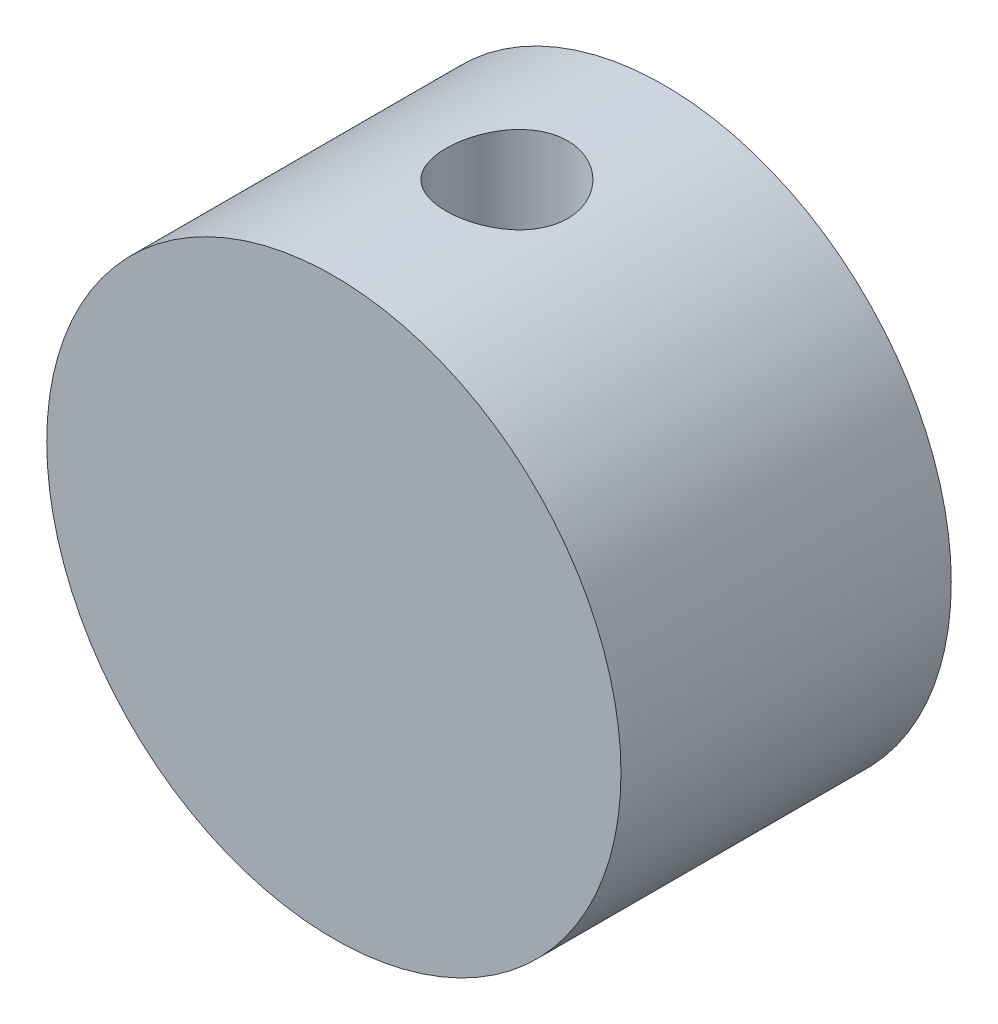
ISO-10303-21;
HEADER;
FILE_DESCRIPTION(('STEP AP214'),'2;1');
FILE_NAME('part.step','',(''),(''),'','','');
FILE_SCHEMA(('AUTOMOTIVE_DESIGN { 1 0 10303 214 1 1 1 1 }'));
ENDSEC;
DATA;
#1=APPLICATION_CONTEXT('core data for automotive mechanical design processes');
#2=APPLICATION_PROTOCOL_DEFINITION('international standard','automotive_design',2000,#1);
#3=PRODUCT_CONTEXT('',#1,'mechanical');
#4=PRODUCT('Part','Part','',(#3));
#5=PRODUCT_RELATED_PRODUCT_CATEGORY('part','',(#4));
#6=PRODUCT_DEFINITION_FORMATION('','',#4);
#7=PRODUCT_DEFINITION_CONTEXT('part definition',#1,'design');
#8=PRODUCT_DEFINITION('design','',#6,#7);
#9=PRODUCT_DEFINITION_SHAPE('','',#8);
#10=(LENGTH_UNIT() NAMED_UNIT(*) SI_UNIT(.MILLI.,.METRE.));
#11=(NAMED_UNIT(*) PLANE_ANGLE_UNIT() SI_UNIT($,.RADIAN.));
#12=(NAMED_UNIT(*) SI_UNIT($,.STERADIAN.) SOLID_ANGLE_UNIT());
#13=UNCERTAINTY_MEASURE_WITH_UNIT(LENGTH_MEASURE(1.E-05),#10,'distance_accuracy_value','');
#14=(GEOMETRIC_REPRESENTATION_CONTEXT(3) GLOBAL_UNCERTAINTY_ASSIGNED_CONTEXT((#13)) GLOBAL_UNIT_ASSIGNED_CONTEXT((#10,
#11,#12)) REPRESENTATION_CONTEXT('',''));
#15=CARTESIAN_POINT('',(0.,0.,0.));
#16=DIRECTION('',(0.,0.,1.));
#17=DIRECTION('',(1.,0.,0.));
#18=AXIS2_PLACEMENT_3D('',#15,#16,#17);
#19=CARTESIAN_POINT('',(0.,0.,19.));
#20=DIRECTION('',(0.,0.,-1.));
#21=DIRECTION('',(-1.,0.,0.));
#22=AXIS2_PLACEMENT_3D('',#19,#20,#21);
#23=CYLINDRICAL_SURFACE('',#22,16.515);
#24=CARTESIAN_POINT('',(-14.7761661082379,7.37632294180248,9.5));
#25=CARTESIAN_POINT('',(-14.7761652243296,7.37632528414198,9.44388483014353));
#26=CARTESIAN_POINT('',(-14.7740472993496,7.38057204953592,9.38773028243603));
#27=CARTESIAN_POINT('',(-14.7656081753143,7.39744048464333,9.2769715054375));
#28=CARTESIAN_POINT('',(-14.7592820735609,7.41007192280703,9.22236916198914));
#29=CARTESIAN_POINT('',(-14.7425473387191,7.44331022843231,9.11633519685663));
#30=CARTESIAN_POINT('',(-14.7321408479884,7.46391291061587,9.06490192766041));
#31=CARTESIAN_POINT('',(-14.7074501442354,7.51244786938125,8.96664731382157));
#32=CARTESIAN_POINT('',(-14.6931668237851,7.54037845879169,8.91982491098532));
#33=CARTESIAN_POINT('',(-14.660989230412,7.60275273454493,8.83204115451057));
#34=CARTESIAN_POINT('',(-14.64309046402,7.63720452239516,8.79108720384865));
#35=CARTESIAN_POINT('',(-14.6040723570013,7.7115533075833,8.71626620352635));
#36=CARTESIAN_POINT('',(-14.5829528825994,7.75145053109501,8.68239944837764));
#37=CARTESIAN_POINT('',(-14.5379523546034,7.83552410036968,8.62269189559942));
#38=CARTESIAN_POINT('',(-14.514069236682,7.87970364079492,8.59685715134838));
#39=CARTESIAN_POINT('',(-14.4641285980377,7.97100455324249,8.5539857491042));
#40=CARTESIAN_POINT('',(-14.4380710994283,8.0181258953456,8.53694900164846));
#41=CARTESIAN_POINT('',(-14.3844831930307,8.11386914763816,8.51217754744945));
#42=CARTESIAN_POINT('',(-14.3569546489544,8.16248912757433,8.50443134900294));
#43=CARTESIAN_POINT('',(-14.301144167903,8.25988196198706,8.49842539493915));
#44=CARTESIAN_POINT('',(-14.2728622389861,8.30865481482354,8.50016553789406));
#45=CARTESIAN_POINT('',(-14.2163949655969,8.40490626394991,8.51307338110252));
#46=CARTESIAN_POINT('',(-14.1882095431099,8.4523864732439,8.52422871834687));
#47=CARTESIAN_POINT('',(-14.1327455179071,8.54480165986377,8.55563110945947));
#48=CARTESIAN_POINT('',(-14.1054669202891,8.58973662288239,8.57587821442836));
#49=CARTESIAN_POINT('',(-14.0526542746077,8.67586822544373,8.62490341568168));
#50=CARTESIAN_POINT('',(-14.027121386936,8.71706238429111,8.65368711977945));
#51=CARTESIAN_POINT('',(-13.978650281993,8.79458097746715,8.71896437298439));
#52=CARTESIAN_POINT('',(-13.9557120920705,8.83090536046791,8.75545800334445));
#53=CARTESIAN_POINT('',(-13.9131667705874,8.89778581949954,8.83518902398001));
#54=CARTESIAN_POINT('',(-13.8935650445289,8.92833254371431,8.87843714410653));
#55=CARTESIAN_POINT('',(-13.8584174267222,8.98279162308439,8.97041187910648));
#56=CARTESIAN_POINT('',(-13.8428715364849,9.00670397576837,9.01913849602066));
#57=CARTESIAN_POINT('',(-13.8163875966016,9.04727852696736,9.12069386118637));
#58=CARTESIAN_POINT('',(-13.8054497867521,9.06394034817897,9.17352282274731));
#59=CARTESIAN_POINT('',(-13.7885802159207,9.08958295216907,9.28178014336961));
#60=CARTESIAN_POINT('',(-13.7826483996805,9.09856381973332,9.33720847373086));
#61=CARTESIAN_POINT('',(-13.7760140623172,9.10860573797921,9.44899692513167));
#62=CARTESIAN_POINT('',(-13.7753032551641,9.10967933793887,9.50535542737751));
#63=CARTESIAN_POINT('',(-13.7791152253338,9.1039123508736,9.61748721611554));
#64=CARTESIAN_POINT('',(-13.7836379771199,9.09707180246506,9.67326050546188));
#65=CARTESIAN_POINT('',(-13.7977454800249,9.07566014935453,9.78259626830247));
#66=CARTESIAN_POINT('',(-13.8073264419236,9.06109483141567,9.83616036441343));
#67=CARTESIAN_POINT('',(-13.8312005273048,9.0246102135982,9.93960731856602));
#68=CARTESIAN_POINT('',(-13.845493690895,9.00269085112575,9.98949014527017));
#69=CARTESIAN_POINT('',(-13.8783039639915,8.95202840548346,10.0842275403652));
#70=CARTESIAN_POINT('',(-13.896826371324,8.9232767618976,10.129075695992));
#71=CARTESIAN_POINT('',(-13.9374395170237,8.85970787114894,10.2124060901591));
#72=CARTESIAN_POINT('',(-13.9595302882587,8.82489056811577,10.2508882700566));
#73=CARTESIAN_POINT('',(-14.0065618989229,8.75005147365633,10.3204450040569));
#74=CARTESIAN_POINT('',(-14.0315064119925,8.71002296445924,10.3515098473893));
#75=CARTESIAN_POINT('',(-14.0833999986001,8.6258628659427,10.4052836521311));
#76=CARTESIAN_POINT('',(-14.1103490603897,8.58173130067032,10.4279926625083));
#77=CARTESIAN_POINT('',(-14.1653752231236,8.49059473438645,10.4643932696884));
#78=CARTESIAN_POINT('',(-14.193451539888,8.44359171943399,10.4780910237219));
#79=CARTESIAN_POINT('',(-14.249891640185,8.34798738262633,10.4961004418209));
#80=CARTESIAN_POINT('',(-14.2782554210928,8.29938607535561,10.5004121915102));
#81=CARTESIAN_POINT('',(-14.3343980329704,8.20203696404428,10.499526381745));
#82=CARTESIAN_POINT('',(-14.3621777272097,8.15328951879389,10.4943440253942));
#83=CARTESIAN_POINT('',(-14.4164331583958,8.05696820571649,10.4746486173371));
#84=CARTESIAN_POINT('',(-14.4429088930186,8.00939433998115,10.4601355490019));
#85=CARTESIAN_POINT('',(-14.4938685289415,7.91680459234177,10.4221940714782));
#86=CARTESIAN_POINT('',(-14.5183524386728,7.8717886996102,10.3987657000301));
#87=CARTESIAN_POINT('',(-14.5647314934381,7.7856417728284,10.3436608450192));
#88=CARTESIAN_POINT('',(-14.5866267076915,7.74451063490913,10.3119845820702));
#89=CARTESIAN_POINT('',(-14.6273595146655,7.66730006386913,10.2412271603635));
#90=CARTESIAN_POINT('',(-14.6461925134038,7.63122823173418,10.2021350631772));
#91=CARTESIAN_POINT('',(-14.6803595576154,7.56529254205189,10.1176693560236));
#92=CARTESIAN_POINT('',(-14.6956927448835,7.53543020732414,10.0722942097334));
#93=CARTESIAN_POINT('',(-14.7225560205894,7.48281002184311,9.9765013479683));
#94=CARTESIAN_POINT('',(-14.7340815511758,7.46006068724397,9.92607768266163));
#95=CARTESIAN_POINT('',(-14.7530674489264,7.42244393603233,9.82169906561605));
#96=CARTESIAN_POINT('',(-14.760532584486,7.40756727456749,9.76774833975164));
#97=CARTESIAN_POINT('',(-14.7693157895934,7.39003316305229,9.67788888213308));
#98=CARTESIAN_POINT('',(-14.7718822936726,7.38489901213253,9.64256121242076));
#99=CARTESIAN_POINT('',(-14.7753077334888,7.37804315748207,9.57149435714344));
#100=CARTESIAN_POINT('',(-14.776166671442,7.37632144932277,9.53575517211256));
#101=CARTESIAN_POINT('',(-14.7761661082379,7.37632294180248,9.5));
#102=B_SPLINE_CURVE_WITH_KNOTS('',3,(#24,#25,#26,#27,#28,#29,#30,#31,#32,#33,#34,#35,#36,#37,
#38,#39,#40,#41,#42,#43,#44,#45,#46,#47,#48,#49,#50,#51,#52,#53,#54,#55,#56,#57,#58,#59,#60,#61,
#62,#63,#64,#65,#66,#67,#68,#69,#70,#71,#72,#73,#74,#75,#76,#77,#78,#79,#80,#81,#82,#83,#84,#85,
#86,#87,#88,#89,#90,#91,#92,#93,#94,#95,#96,#97,#98,#99,#100,#101),.UNSPECIFIED.,.T.,.F.,(4,2,2,
2,2,2,2,2,2,2,2,2,2,2,2,2,2,2,2,2,2,2,2,2,2,2,2,2,2,2,2,2,2,2,2,2,2,2,4),(0.,0.168214982353931,
0.336626286081308,0.504949285687176,0.673233564700608,0.841728297730832,1.01023003124736,
1.17885845108508,1.34748515618787,1.51590306704608,1.68431917718607,1.85251448504303,
2.02071073826053,2.18901772765079,2.35732649087288,2.52590539283143,2.6944843575862,
2.8630720938102,3.03165796906472,3.19997623129221,3.36829367222903,3.53648520128911,
3.70467816194535,3.87308297931276,4.04148934792718,4.21011499972513,4.37873966330937,
4.54724898867133,4.71575677680375,4.88399496583638,5.05223345469998,5.22047123138157,
5.38870450851418,5.55718788846907,5.72571253874908,5.89443819204182,6.06296526924675,
6.17014775603146,6.27733010371677),.UNSPECIFIED.);
#103=CARTESIAN_POINT('',(-14.7761661082379,7.37632294180248,9.5));
#104=VERTEX_POINT('',#103);
#105=EDGE_CURVE('E72',#104,#104,#102,.T.);
#106=ORIENTED_EDGE('',*,*,#105,.T.);
#107=EDGE_LOOP('',(#106));
#108=FACE_BOUND('',#107,.T.);
#109=CARTESIAN_POINT('',(0.,0.,19.));
#110=DIRECTION('',(0.,0.,1.));
#111=DIRECTION('',(1.,0.,0.));
#112=AXIS2_PLACEMENT_3D('',#109,#110,#111);
#113=CIRCLE('',#112,16.515);
#114=CARTESIAN_POINT('',(16.515,0.,19.));
#115=VERTEX_POINT('',#114);
#116=EDGE_CURVE('E75',#115,#115,#113,.T.);
#117=ORIENTED_EDGE('',*,*,#116,.F.);
#118=EDGE_LOOP('',(#117));
#119=FACE_BOUND('',#118,.T.);
#120=CARTESIAN_POINT('',(0.,0.,0.));
#121=DIRECTION('',(0.,0.,1.));
#122=DIRECTION('',(1.,0.,0.));
#123=AXIS2_PLACEMENT_3D('',#120,#121,#122);
#124=CIRCLE('',#123,16.515);
#125=CARTESIAN_POINT('',(16.515,0.,0.));
#126=VERTEX_POINT('',#125);
#127=EDGE_CURVE('E71',#126,#126,#124,.T.);
#128=ORIENTED_EDGE('',*,*,#127,.T.);
#129=EDGE_LOOP('',(#128));
#130=FACE_BOUND('',#129,.T.);
#131=CARTESIAN_POINT('',(0.,16.515,5.54522428194513));
#132=CARTESIAN_POINT('',(-0.194268258408886,16.5149964042745,5.54523111698136));
#133=CARTESIAN_POINT('',(-0.388620498995079,16.5115372295373,5.56145325990692));
#134=CARTESIAN_POINT('',(-0.771814509390183,16.4980718368677,5.62585176936592));
#135=CARTESIAN_POINT('',(-0.960652068179765,16.4880607457351,5.67405192094645));
#136=CARTESIAN_POINT('',(-1.32722247979265,16.4626073818898,5.80083694613491));
#137=CARTESIAN_POINT('',(-1.50496636451044,16.4471706093437,5.87939105706124));
#138=CARTESIAN_POINT('',(-1.84474309290281,16.4125364275293,6.06455878396817));
#139=CARTESIAN_POINT('',(-2.00677653826298,16.3933391623673,6.17117132477285));
#140=CARTESIAN_POINT('',(-2.31299070870651,16.3529662194163,6.41113619883583));
#141=CARTESIAN_POINT('',(-2.45689986614495,16.3317672644705,6.54483118924274));
#142=CARTESIAN_POINT('',(-2.72042687219415,16.2899461771844,6.8344298550082));
#143=CARTESIAN_POINT('',(-2.84004265848192,16.2693240939443,6.99033541396564));
#144=CARTESIAN_POINT('',(-3.05276989700587,16.2307630178514,7.32191726963809));
#145=CARTESIAN_POINT('',(-3.1455951892687,16.2128538996209,7.49778093656089));
#146=CARTESIAN_POINT('',(-3.30027177619758,16.1820793325168,7.86305244088626));
#147=CARTESIAN_POINT('',(-3.36212653204076,16.1692133200753,8.0524587620962));
#148=CARTESIAN_POINT('',(-3.45221460727988,16.1502182138022,8.43650195279116));
#149=CARTESIAN_POINT('',(-3.48092714780599,16.1439931969438,8.63102156336904));
#150=CARTESIAN_POINT('',(-3.50540524763926,16.1386965865558,9.02220890576597));
#151=CARTESIAN_POINT('',(-3.50117460094208,16.1396241692767,9.21887638761424));
#152=CARTESIAN_POINT('',(-3.46027273988694,16.1484409909182,9.60523541741545));
#153=CARTESIAN_POINT('',(-3.42415546783608,16.1562113496322,9.79498872998032));
#154=CARTESIAN_POINT('',(-3.32138199819804,16.1776505348042,10.1656802206517));
#155=CARTESIAN_POINT('',(-3.25472418171473,16.1913196739432,10.3466179308973));
#156=CARTESIAN_POINT('',(-3.09224562921909,16.2231350348401,10.6961138789394));
#157=CARTESIAN_POINT('',(-2.99620945631786,16.2413141362867,10.8645688439489));
#158=CARTESIAN_POINT('',(-2.7778519786253,16.2800805840243,11.1831786154098));
#159=CARTESIAN_POINT('',(-2.65552729929598,16.3006682393359,11.3333310685679));
#160=CARTESIAN_POINT('',(-2.38512033539038,16.34244400857,11.6142654746604));
#161=CARTESIAN_POINT('',(-2.23656635240011,16.3636358365481,11.7445932755464));
#162=CARTESIAN_POINT('',(-1.91947432818689,16.4038514926646,11.9785567593361));
#163=CARTESIAN_POINT('',(-1.75093596669967,16.4228752860491,12.0821920143877));
#164=CARTESIAN_POINT('',(-1.39812365682072,16.4566673423158,12.2599302135396));
#165=CARTESIAN_POINT('',(-1.21382032424898,16.4714274237781,12.333976483794));
#166=CARTESIAN_POINT('',(-0.835005893131743,16.4949677559984,12.4499249360139));
#167=CARTESIAN_POINT('',(-0.640496190077172,16.5037488219691,12.491831500187));
#168=CARTESIAN_POINT('',(-0.250688650011093,16.5142266325189,12.5416569743443));
#169=CARTESIAN_POINT('',(-0.0554735389885598,16.5160527579378,12.5501966776535));
#170=CARTESIAN_POINT('',(0.333593873323456,16.5127763021464,12.5347246383598));
#171=CARTESIAN_POINT('',(0.527446260324851,16.5076741606977,12.5107149617819));
#172=CARTESIAN_POINT('',(0.90624876475028,16.491195846503,12.4313408847759));
#173=CARTESIAN_POINT('',(1.09126961895986,16.4798843313503,12.3762994577831));
#174=CARTESIAN_POINT('',(1.44945407289572,16.4522523004087,12.2367807163541));
#175=CARTESIAN_POINT('',(1.62261670471487,16.4359313763299,12.1523010024866));
#176=CARTESIAN_POINT('',(1.95475537773441,16.3997704570263,11.9549918968582));
#177=CARTESIAN_POINT('',(2.11350779640806,16.3798858399736,11.8417944283759));
#178=CARTESIAN_POINT('',(2.40998681531251,16.3388992309484,11.590750774461));
#179=CARTESIAN_POINT('',(2.54771085956256,16.3177970914159,11.452901597049));
#180=CARTESIAN_POINT('',(2.80065638710283,16.2763108718577,11.1536269880036));
#181=CARTESIAN_POINT('',(2.91544932665819,16.2559454253662,10.9918363039815));
#182=CARTESIAN_POINT('',(3.11623420392054,16.2186553237612,10.6509064182606));
#183=CARTESIAN_POINT('',(3.20222735856354,16.2017305232749,10.4717679500054));
#184=CARTESIAN_POINT('',(3.34240988179037,16.1733930002063,10.102171034266));
#185=CARTESIAN_POINT('',(3.39677356752524,16.1619501284005,9.91178112688893));
#186=CARTESIAN_POINT('',(3.47267189811315,16.1458139402897,9.52429702883277));
#187=CARTESIAN_POINT('',(3.4942114259723,16.1411196200586,9.32720383981166));
#188=CARTESIAN_POINT('',(3.5036521745112,16.1390725314134,8.93622176847247));
#189=CARTESIAN_POINT('',(3.49223196375259,16.1415716627976,8.74234973449314));
#190=CARTESIAN_POINT('',(3.43758718380125,16.153296454035,8.35935893324618));
#191=CARTESIAN_POINT('',(3.39436294296578,16.1625220444417,8.17024011692532));
#192=CARTESIAN_POINT('',(3.27765572139555,16.1865902644964,7.80262320789376));
#193=CARTESIAN_POINT('',(3.20426571815857,16.2014156231477,7.62409439248658));
#194=CARTESIAN_POINT('',(3.02939235299252,16.2350207885067,7.28178087914111));
#195=CARTESIAN_POINT('',(2.92790627319603,16.2538009777419,7.11799760964202));
#196=CARTESIAN_POINT('',(2.6974459379001,16.2936461712115,6.80646658149573));
#197=CARTESIAN_POINT('',(2.56798564902923,16.3147478335082,6.65908299498383));
#198=CARTESIAN_POINT('',(2.28624384956393,16.3566059180029,6.38790882014598));
#199=CARTESIAN_POINT('',(2.13395708591303,16.3773622595074,6.26412367746565));
#200=CARTESIAN_POINT('',(1.80868183047199,16.4164862722369,6.04224293718726));
#201=CARTESIAN_POINT('',(1.63546656579737,16.4348222428316,5.94447391247287));
#202=CARTESIAN_POINT('',(1.27471487973924,16.4667239850175,5.77959074459904));
#203=CARTESIAN_POINT('',(1.08719096991871,16.4802938672182,5.71245017030054));
#204=CARTESIAN_POINT('',(0.749491188002404,16.4986325451218,5.62308500240277));
#205=CARTESIAN_POINT('',(0.601179479365196,16.504733114025,5.59394155816324));
#206=CARTESIAN_POINT('',(0.301928688567538,16.5129181597652,5.55500892266337));
#207=CARTESIAN_POINT('',(0.150989710059184,16.5150027946796,5.54521896959946));
#208=CARTESIAN_POINT('',(0.,16.515,5.54522428194513));
#209=B_SPLINE_CURVE_WITH_KNOTS('',3,(#131,#132,#133,#134,#135,#136,#137,#138,#139,#140,#141,
#142,#143,#144,#145,#146,#147,#148,#149,#150,#151,#152,#153,#154,#155,#156,#157,#158,#159,#160,
#161,#162,#163,#164,#165,#166,#167,#168,#169,#170,#171,#172,#173,#174,#175,#176,#177,#178,#179,
#180,#181,#182,#183,#184,#185,#186,#187,#188,#189,#190,#191,#192,#193,#194,#195,#196,#197,#198,
#199,#200,#201,#202,#203,#204,#205,#206,#207,#208),.UNSPECIFIED.,.T.,.F.,(4,2,2,2,2,2,2,2,2,2,2,
2,2,2,2,2,2,2,2,2,2,2,2,2,2,2,2,2,2,2,2,2,2,2,2,2,2,2,4),(0.,0.582252212368086,1.16493798662306,
1.74703477143698,2.32910925402839,2.91906858330467,3.50907797473896,4.10517414271649,
4.70120367784113,5.28850245753005,5.87573360028841,6.45295964686112,7.03021629462864,
7.61181188834836,8.19348218353372,8.78693878693228,9.38040490219168,9.97500233780395,
10.5695186864002,11.1529198073369,11.7362838994599,12.3136856371321,12.8911344481981,
13.4763954883651,14.0617276099718,14.6571436737524,15.2525345750292,15.8446122760496,
16.4366018894675,17.0164912236251,17.5963745708621,18.1744838356557,18.7526490432666,
19.3418090424092,19.9311048336943,20.5274819050925,21.1233433486,21.5759008285429,
22.0284404942959),.UNSPECIFIED.);
#210=CARTESIAN_POINT('',(0.,16.515,5.54522428194513));
#211=VERTEX_POINT('',#210);
#212=EDGE_CURVE('E57',#211,#211,#209,.T.);
#213=ORIENTED_EDGE('',*,*,#212,.F.);
#214=EDGE_LOOP('',(#213));
#215=FACE_BOUND('',#214,.T.);
#216=ADVANCED_FACE('F38',(#108,#119,#130,#215),#23,.T.);
#217=CARTESIAN_POINT('',(0.,0.,19.));
#218=DIRECTION('',(0.,0.,1.));
#219=DIRECTION('',(1.,0.,0.));
#220=AXIS2_PLACEMENT_3D('',#217,#218,#219);
#221=PLANE('',#220);
#222=ORIENTED_EDGE('',*,*,#116,.T.);
#223=EDGE_LOOP('',(#222));
#224=FACE_BOUND('',#223,.T.);
#225=ADVANCED_FACE('F97',(#224),#221,.T.);
#226=CARTESIAN_POINT('',(0.,0.,0.));
#227=DIRECTION('',(0.,0.,1.));
#228=DIRECTION('',(1.,0.,0.));
#229=AXIS2_PLACEMENT_3D('',#226,#227,#228);
#230=PLANE('',#229);
#231=ORIENTED_EDGE('',*,*,#127,.F.);
#232=EDGE_LOOP('',(#231));
#233=FACE_BOUND('',#232,.T.);
#234=ADVANCED_FACE('F95',(#233),#230,.F.);
#235=CARTESIAN_POINT('',(0.,16.515,9.04522428194512));
#236=DIRECTION('',(0.,-1.,0.));
#237=DIRECTION('',(0.,0.,-1.));
#238=AXIS2_PLACEMENT_3D('',#235,#236,#237);
#239=CYLINDRICAL_SURFACE('',#238,3.5);
#240=CARTESIAN_POINT('',(-3.47032837729626,0.84889448442913,9.5));
#241=CARTESIAN_POINT('',(-3.47774865840747,0.85318037436974,9.44336960383856));
#242=CARTESIAN_POINT('',(-3.48372681886441,0.862202126108502,9.38689612109741));
#243=CARTESIAN_POINT('',(-3.49283180105305,0.88936736742539,9.27594201973958));
#244=CARTESIAN_POINT('',(-3.49595747204672,0.907514533761022,9.22146221390254));
#245=CARTESIAN_POINT('',(-3.49967801555569,0.952357446995239,9.11613837699742));
#246=CARTESIAN_POINT('',(-3.50027611230746,0.979042256267095,9.06528979534635));
#247=CARTESIAN_POINT('',(-3.49949507687479,1.04021394143562,8.96856106982136));
#248=CARTESIAN_POINT('',(-3.49811612323947,1.07470011254771,8.92268047768649));
#249=CARTESIAN_POINT('',(-3.49402084777728,1.15138965697751,8.83607287741252));
#250=CARTESIAN_POINT('',(-3.49127464505778,1.19375156478922,8.79548782304107));
#251=CARTESIAN_POINT('',(-3.48521047569994,1.28441566545259,8.72167602123832));
#252=CARTESIAN_POINT('',(-3.48189242012698,1.33271878194683,8.68845042018975));
#253=CARTESIAN_POINT('',(-3.47525675640495,1.43615083808023,8.62864350981465));
#254=CARTESIAN_POINT('',(-3.47194565158555,1.49148712322762,8.60242083038336));
#255=CARTESIAN_POINT('',(-3.4661149891433,1.60558806346339,8.55888051621318));
#256=CARTESIAN_POINT('',(-3.46359569674676,1.66435385950582,8.54156586408218));
#257=CARTESIAN_POINT('',(-3.45960085673995,1.7883799748223,8.51478843880795));
#258=CARTESIAN_POINT('',(-3.45821957785981,1.85379377147504,8.50602530345225));
#259=CARTESIAN_POINT('',(-3.45702090910574,1.98519882461055,8.49839885544792));
#260=CARTESIAN_POINT('',(-3.45720407180101,2.05119027690236,8.49953904070794));
#261=CARTESIAN_POINT('',(-3.45913720563396,2.18887906129512,8.511917245817));
#262=CARTESIAN_POINT('',(-3.46104244061785,2.26048503173797,8.52415632167607));
#263=CARTESIAN_POINT('',(-3.46621533689943,2.40092337610217,8.55976371542278));
#264=CARTESIAN_POINT('',(-3.46948484832932,2.4697518438357,8.58314715262547));
#265=CARTESIAN_POINT('',(-3.47687839179331,2.60616342048778,8.64240793508363));
#266=CARTESIAN_POINT('',(-3.48103841494181,2.67348910392224,8.67887951945747));
#267=CARTESIAN_POINT('',(-3.48894419510524,2.79994638438959,8.7640024786969));
#268=CARTESIAN_POINT('',(-3.49269102272608,2.85909926320921,8.81262125744372));
#269=CARTESIAN_POINT('',(-3.49725654975171,2.94637229881245,8.90230223603732));
#270=CARTESIAN_POINT('',(-3.49864280393367,2.9780433446521,8.93989292428014));
#271=CARTESIAN_POINT('',(-3.50013348488755,3.03500874648114,9.01967222808311));
#272=CARTESIAN_POINT('',(-3.50023914518423,3.06030921587914,9.06185637947987));
#273=CARTESIAN_POINT('',(-3.49870049364706,3.10326590672763,9.15042805135678));
#274=CARTESIAN_POINT('',(-3.49704105784493,3.1208542101753,9.19684873261997));
#275=CARTESIAN_POINT('',(-3.49160730709257,3.14677484940717,9.29208955575023));
#276=CARTESIAN_POINT('',(-3.4878348133763,3.155115137589,9.34090759833117));
#277=CARTESIAN_POINT('',(-3.47877019467516,3.16160147655055,9.43251593134677));
#278=CARTESIAN_POINT('',(-3.47374382122859,3.16094602798283,9.47525283663624));
#279=CARTESIAN_POINT('',(-3.46222674161903,3.15258442126963,9.55981858928191));
#280=CARTESIAN_POINT('',(-3.45573583538922,3.14487729936962,9.60164731171648));
#281=CARTESIAN_POINT('',(-3.4415634141796,3.12309189549004,9.68348241875807));
#282=CARTESIAN_POINT('',(-3.43387894348364,3.1089976257134,9.72348395141083));
#283=CARTESIAN_POINT('',(-3.41767382441394,3.07535068155955,9.80091882105807));
#284=CARTESIAN_POINT('',(-3.40915275537085,3.05579525192075,9.83835084978075));
#285=CARTESIAN_POINT('',(-3.38709738615547,3.00089754413758,9.92880448829567));
#286=CARTESIAN_POINT('',(-3.37323565750175,2.9626051516692,9.97996111887931));
#287=CARTESIAN_POINT('',(-3.34536044516949,2.87815819090904,10.075294424352));
#288=CARTESIAN_POINT('',(-3.33134667312544,2.83198461111655,10.1194537110476));
#289=CARTESIAN_POINT('',(-3.30018283784606,2.71988767702866,10.212191331183));
#290=CARTESIAN_POINT('',(-3.283254754938,2.65205629258769,10.258538608186));
#291=CARTESIAN_POINT('',(-3.25206681443311,2.50929000751969,10.3398118646943));
#292=CARTESIAN_POINT('',(-3.23780970267019,2.43434791478733,10.3747261179989));
#293=CARTESIAN_POINT('',(-3.21333761325919,2.27863974217768,10.4328345812946));
#294=CARTESIAN_POINT('',(-3.20315870550864,2.19782885133582,10.4559246893771));
#295=CARTESIAN_POINT('',(-3.18861396863783,2.03304308415033,10.4885109125959));
#296=CARTESIAN_POINT('',(-3.1842354382163,1.94907553639187,10.4980367333947));
#297=CARTESIAN_POINT('',(-3.18290369938421,1.80447559512993,10.5009421171243));
#298=CARTESIAN_POINT('',(-3.18420601614559,1.74393398519071,10.4981146374364));
#299=CARTESIAN_POINT('',(-3.19084334974855,1.62414523244427,10.4834834509546));
#300=CARTESIAN_POINT('',(-3.19617530496041,1.56489714199545,10.4716865588798));
#301=CARTESIAN_POINT('',(-3.21086569486332,1.44919837355699,10.4383055190314));
#302=CARTESIAN_POINT('',(-3.22025445054983,1.39277240406121,10.4166476019865));
#303=CARTESIAN_POINT('',(-3.24241621010593,1.28554073951341,10.3633897672654));
#304=CARTESIAN_POINT('',(-3.25518721907273,1.23473175643749,10.3317957080193));
#305=CARTESIAN_POINT('',(-3.28117004287605,1.14670513360975,10.2638591335425));
#306=CARTESIAN_POINT('',(-3.29413243868647,1.10858385855007,10.2285856064853));
#307=CARTESIAN_POINT('',(-3.32068822897611,1.03942385136616,10.1518733369972));
#308=CARTESIAN_POINT('',(-3.33428155077847,1.00838430591653,10.110435303454));
#309=CARTESIAN_POINT('',(-3.36056003485425,0.955171132618373,10.0242977981496));
#310=CARTESIAN_POINT('',(-3.37326006629293,0.932704795540679,9.97978271444561));
#311=CARTESIAN_POINT('',(-3.39750341163018,0.895370321025869,9.88739372028661));
#312=CARTESIAN_POINT('',(-3.40904689233477,0.880501086608477,9.83952029589374));
#313=CARTESIAN_POINT('',(-3.43000091361561,0.858885151242563,9.74338535405247));
#314=CARTESIAN_POINT('',(-3.43947215987434,0.851871340934869,9.69519661275693));
#315=CARTESIAN_POINT('',(-3.45643083334358,0.845023796278265,9.59796634333786));
#316=CARTESIAN_POINT('',(-3.46391778489679,0.845191781921441,9.54892461374045));
#317=CARTESIAN_POINT('',(-3.47032837729626,0.84889448442913,9.5));
#318=B_SPLINE_CURVE_WITH_KNOTS('',3,(#240,#241,#242,#243,#244,#245,#246,#247,#248,#249,#250,
#251,#252,#253,#254,#255,#256,#257,#258,#259,#260,#261,#262,#263,#264,#265,#266,#267,#268,#269,
#270,#271,#272,#273,#274,#275,#276,#277,#278,#279,#280,#281,#282,#283,#284,#285,#286,#287,#288,
#289,#290,#291,#292,#293,#294,#295,#296,#297,#298,#299,#300,#301,#302,#303,#304,#305,#306,#307,
#308,#309,#310,#311,#312,#313,#314,#315,#316,#317),.UNSPECIFIED.,.T.,.F.,(4,2,2,2,2,2,2,2,2,2,2,
2,2,2,2,2,2,2,2,2,2,2,2,2,2,2,2,2,2,2,2,2,2,2,2,2,2,2,4),(0.,0.171641782453726,
0.343352777267134,0.514844667030154,0.686321070188846,0.861721362517068,1.03714895778065,
1.22033120960372,1.40357475511377,1.60079522345233,1.79808535400384,2.01515795868477,
2.2325259030731,2.46136545557353,2.68959740788226,2.83657959360885,2.98342018831658,
3.13152917742542,3.27951070813915,3.40799232039426,3.53649149489746,3.6653141102238,
3.79420183685343,3.98927379197559,4.18482314012483,4.43518693621571,4.68580671771944,
4.93859662084864,5.19083206050462,5.37200161466173,5.55303365842803,5.73544281787875,
5.91774462840524,6.07752238696717,6.23728178605966,6.39095496438501,6.54460594686426,
6.69285667086863,6.84114290012848),.UNSPECIFIED.);
#319=CARTESIAN_POINT('',(-3.47032837729626,0.84889448442913,9.5));
#320=VERTEX_POINT('',#319);
#321=EDGE_CURVE('E60',#320,#320,#318,.T.);
#322=ORIENTED_EDGE('',*,*,#321,.F.);
#323=EDGE_LOOP('',(#322));
#324=FACE_BOUND('',#323,.T.);
#325=CARTESIAN_POINT('',(0.,0.,9.04522428194512));
#326=DIRECTION('',(0.,1.,0.));
#327=DIRECTION('',(0.,0.,1.));
#328=AXIS2_PLACEMENT_3D('',#325,#326,#327);
#329=CIRCLE('',#328,3.5);
#330=CARTESIAN_POINT('',(0.,0.,12.5452242819451));
#331=VERTEX_POINT('',#330);
#332=EDGE_CURVE('E69',#331,#331,#329,.T.);
#333=ORIENTED_EDGE('',*,*,#332,.F.);
#334=EDGE_LOOP('',(#333));
#335=FACE_BOUND('',#334,.T.);
#336=ORIENTED_EDGE('',*,*,#212,.T.);
#337=EDGE_LOOP('',(#336));
#338=FACE_BOUND('',#337,.T.);
#339=ADVANCED_FACE('F65',(#324,#335,#338),#239,.F.);
#340=CARTESIAN_POINT('',(0.,0.,9.04522428194512));
#341=DIRECTION('',(0.,1.,0.));
#342=DIRECTION('',(0.,0.,1.));
#343=AXIS2_PLACEMENT_3D('',#340,#341,#342);
#344=PLANE('',#343);
#345=CARTESIAN_POINT('',(0.,0.,9.5));
#346=DIRECTION('',(0.,1.,0.));
#347=DIRECTION('',(-1.,0.,0.));
#348=AXIS2_PLACEMENT_3D('',#345,#346,#347);
#349=ELLIPSE('',#348,2.00000000000001,1.);
#350=CARTESIAN_POINT('',(-1.15470053837925,0.,8.68350341907227));
#351=VERTEX_POINT('',#350);
#352=CARTESIAN_POINT('',(-1.15470053837925,0.,10.3164965809277));
#353=VERTEX_POINT('',#352);
#354=EDGE_CURVE('E11',#351,#353,#349,.T.);
#355=ORIENTED_EDGE('',*,*,#354,.F.);
#356=DIRECTION('',(0.,0.,1.));
#357=VECTOR('',#356,1.);
#358=CARTESIAN_POINT('',(-1.15470053837925,0.,9.04522428194512));
#359=LINE('',#358,#357);
#360=EDGE_CURVE('E46',#351,#353,#359,.T.);
#361=ORIENTED_EDGE('',*,*,#360,.T.);
#362=EDGE_LOOP('',(#355,#361));
#363=FACE_BOUND('',#362,.T.);
#364=ORIENTED_EDGE('',*,*,#332,.T.);
#365=EDGE_LOOP('',(#364));
#366=FACE_BOUND('',#365,.T.);
#367=ADVANCED_FACE('F62',(#363,#366),#344,.T.);
#368=CARTESIAN_POINT('',(-0.866025403784443,0.5,9.5));
#369=DIRECTION('',(-0.86602540378444,0.499999999999998,0.));
#370=DIRECTION('',(-0.499999999999998,-0.86602540378444,0.));
#371=AXIS2_PLACEMENT_3D('',#368,#369,#370);
#372=PLANE('',#371);
#373=CARTESIAN_POINT('',(-0.866025403784443,0.5,9.5));
#374=DIRECTION('',(-0.86602540378444,0.499999999999998,0.));
#375=DIRECTION('',(-0.499999999999998,-0.86602540378444,0.));
#376=AXIS2_PLACEMENT_3D('',#373,#374,#375);
#377=CIRCLE('',#376,1.);
#378=EDGE_CURVE('E52',#351,#353,#377,.T.);
#379=ORIENTED_EDGE('',*,*,#378,.T.);
#380=ORIENTED_EDGE('',*,*,#360,.F.);
#381=EDGE_LOOP('',(#379,#380));
#382=FACE_BOUND('',#381,.T.);
#383=ADVANCED_FACE('F54',(#382),#372,.T.);
#384=CARTESIAN_POINT('',(-0.866025403784443,0.5,9.5));
#385=DIRECTION('',(-0.86602540378444,0.499999999999998,0.));
#386=DIRECTION('',(-0.499999999999998,-0.86602540378444,0.));
#387=AXIS2_PLACEMENT_3D('',#384,#385,#386);
#388=CYLINDRICAL_SURFACE('',#387,1.);
#389=ORIENTED_EDGE('',*,*,#354,.T.);
#390=ORIENTED_EDGE('',*,*,#378,.F.);
#391=EDGE_LOOP('',(#389,#390));
#392=FACE_BOUND('',#391,.T.);
#393=ADVANCED_FACE('F59',(#392),#388,.F.);
#394=ORIENTED_EDGE('',*,*,#321,.T.);
#395=EDGE_LOOP('',(#394));
#396=FACE_BOUND('',#395,.T.);
#397=ORIENTED_EDGE('',*,*,#105,.F.);
#398=EDGE_LOOP('',(#397));
#399=FACE_BOUND('',#398,.T.);
#400=ADVANCED_FACE('F106',(#396,#399),#388,.F.);
#401=CLOSED_SHELL('',(#216,#225,#234,#339,#367,#383,#393,#400));
#402=MANIFOLD_SOLID_BREP('B2',#401);
#403=ADVANCED_BREP_SHAPE_REPRESENTATION('',(#18,#402),#14);
#404=SHAPE_DEFINITION_REPRESENTATION(#9,#403);
ENDSEC;
END-ISO-10303-21;
